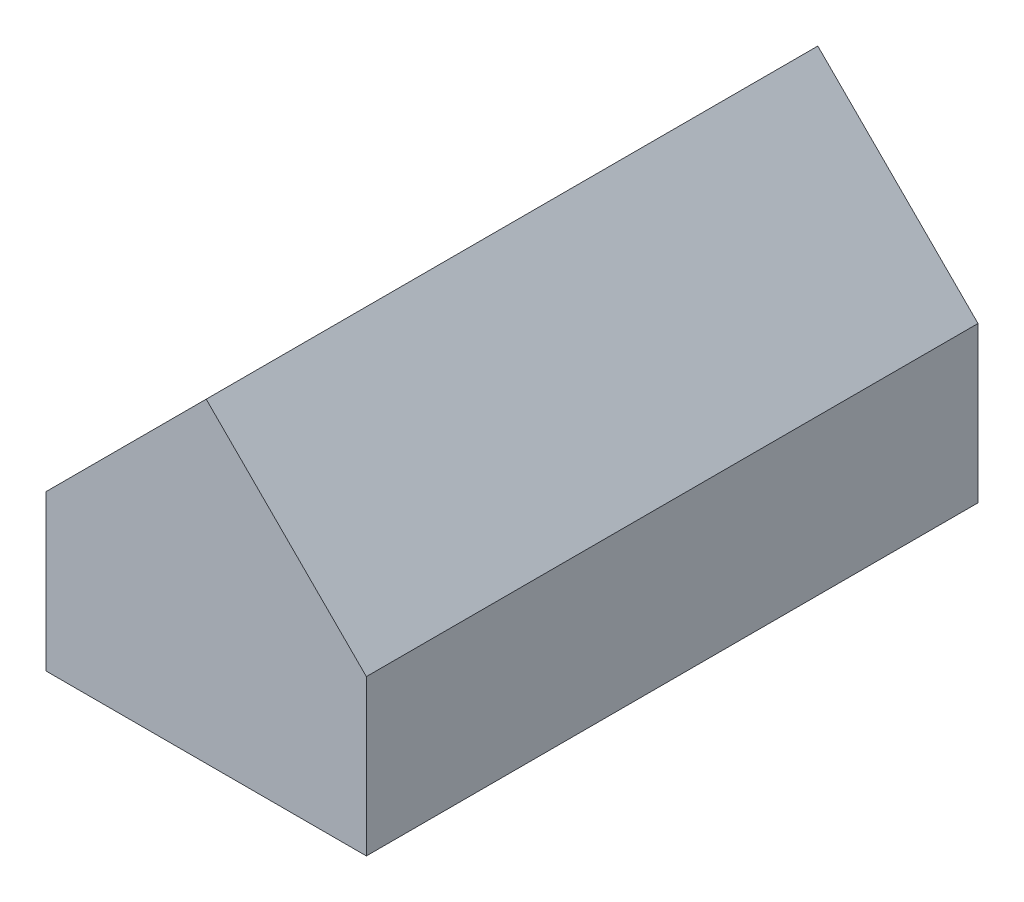
ISO-10303-21;
HEADER;
FILE_DESCRIPTION(('STEP AP214'),'2;1');
FILE_NAME('part.step','',(''),(''),'','','');
FILE_SCHEMA(('AUTOMOTIVE_DESIGN { 1 0 10303 214 1 1 1 1 }'));
ENDSEC;
DATA;
#1=APPLICATION_CONTEXT('core data for automotive mechanical design processes');
#2=APPLICATION_PROTOCOL_DEFINITION('international standard','automotive_design',2000,#1);
#3=PRODUCT_CONTEXT('',#1,'mechanical');
#4=PRODUCT('Part','Part','',(#3));
#5=PRODUCT_RELATED_PRODUCT_CATEGORY('part','',(#4));
#6=PRODUCT_DEFINITION_FORMATION('','',#4);
#7=PRODUCT_DEFINITION_CONTEXT('part definition',#1,'design');
#8=PRODUCT_DEFINITION('design','',#6,#7);
#9=PRODUCT_DEFINITION_SHAPE('','',#8);
#10=(LENGTH_UNIT() NAMED_UNIT(*) SI_UNIT(.MILLI.,.METRE.));
#11=(NAMED_UNIT(*) PLANE_ANGLE_UNIT() SI_UNIT($,.RADIAN.));
#12=(NAMED_UNIT(*) SI_UNIT($,.STERADIAN.) SOLID_ANGLE_UNIT());
#13=UNCERTAINTY_MEASURE_WITH_UNIT(LENGTH_MEASURE(1.E-05),#10,'distance_accuracy_value','');
#14=(GEOMETRIC_REPRESENTATION_CONTEXT(3) GLOBAL_UNCERTAINTY_ASSIGNED_CONTEXT((#13)) GLOBAL_UNIT_ASSIGNED_CONTEXT((#10,
#11,#12)) REPRESENTATION_CONTEXT('',''));
#15=CARTESIAN_POINT('',(0.,0.,0.));
#16=DIRECTION('',(0.,0.,1.));
#17=DIRECTION('',(1.,0.,0.));
#18=AXIS2_PLACEMENT_3D('',#15,#16,#17);
#19=CARTESIAN_POINT('',(0.,0.,6100.));
#20=DIRECTION('',(-1.,0.,0.));
#21=DIRECTION('',(0.,-1.,0.));
#22=AXIS2_PLACEMENT_3D('',#19,#20,#21);
#23=PLANE('',#22);
#24=DIRECTION('',(0.,1.,0.));
#25=VECTOR('',#24,1.);
#26=CARTESIAN_POINT('',(0.,0.,0.));
#27=LINE('',#26,#25);
#28=CARTESIAN_POINT('',(4.4408921777684E-13,-5.83115505291208E-06,0.));
#29=VERTEX_POINT('',#28);
#30=CARTESIAN_POINT('',(-2.22044605038956E-13,1599.99997667537,0.));
#31=VERTEX_POINT('',#30);
#32=EDGE_CURVE('E236',#29,#31,#27,.T.);
#33=ORIENTED_EDGE('',*,*,#32,.T.);
#34=DIRECTION('',(0.,0.,-1.));
#35=VECTOR('',#34,1.);
#36=CARTESIAN_POINT('',(-2.22044605038956E-13,1599.99997667537,6100.));
#37=LINE('',#36,#35);
#38=CARTESIAN_POINT('',(-2.22044605038956E-13,1599.99997667537,6100.));
#39=VERTEX_POINT('',#38);
#40=EDGE_CURVE('E11',#39,#31,#37,.T.);
#41=ORIENTED_EDGE('',*,*,#40,.F.);
#42=DIRECTION('',(0.,1.,0.));
#43=VECTOR('',#42,1.);
#44=CARTESIAN_POINT('',(0.,0.,6100.));
#45=LINE('',#44,#43);
#46=CARTESIAN_POINT('',(1.38777879729552E-13,-5.83115501821761E-06,6100.));
#47=VERTEX_POINT('',#46);
#48=EDGE_CURVE('E228',#47,#39,#45,.T.);
#49=ORIENTED_EDGE('',*,*,#48,.F.);
#50=DIRECTION('',(0.,0.,-1.));
#51=VECTOR('',#50,1.);
#52=CARTESIAN_POINT('',(0.,0.,6100.));
#53=LINE('',#52,#51);
#54=EDGE_CURVE('E52',#47,#29,#53,.T.);
#55=ORIENTED_EDGE('',*,*,#54,.T.);
#56=EDGE_LOOP('',(#33,#41,#49,#55));
#57=FACE_BOUND('',#56,.T.);
#58=ADVANCED_FACE('F35',(#57),#23,.F.);
#59=CARTESIAN_POINT('',(1500.00011662309,3099.99986005227,6100.));
#60=DIRECTION('',(-0.707106726209892,0.707106836163199,0.));
#61=DIRECTION('',(-0.707106836163199,-0.707106726209892,0.));
#62=AXIS2_PLACEMENT_3D('',#59,#60,#61);
#63=PLANE('',#62);
#64=DIRECTION('',(0.707106836163199,0.707106726209892,0.));
#65=VECTOR('',#64,1.);
#66=CARTESIAN_POINT('',(1500.00011662309,3099.99986005227,0.));
#67=LINE('',#66,#65);
#68=CARTESIAN_POINT('',(1500.00011662309,3099.99986005227,0.));
#69=VERTEX_POINT('',#68);
#70=EDGE_CURVE('E232',#31,#69,#67,.T.);
#71=ORIENTED_EDGE('',*,*,#70,.T.);
#72=DIRECTION('',(0.,0.,-1.));
#73=VECTOR('',#72,1.);
#74=CARTESIAN_POINT('',(1500.00011662309,3099.99986005227,6100.));
#75=LINE('',#74,#73);
#76=CARTESIAN_POINT('',(1500.00011662309,3099.99986005227,6100.));
#77=VERTEX_POINT('',#76);
#78=EDGE_CURVE('E44',#77,#69,#75,.T.);
#79=ORIENTED_EDGE('',*,*,#78,.F.);
#80=DIRECTION('',(0.707106836163199,0.707106726209892,0.));
#81=VECTOR('',#80,1.);
#82=CARTESIAN_POINT('',(1500.00011662309,3099.99986005227,6100.));
#83=LINE('',#82,#81);
#84=EDGE_CURVE('E224',#39,#77,#83,.T.);
#85=ORIENTED_EDGE('',*,*,#84,.F.);
#86=ORIENTED_EDGE('',*,*,#40,.T.);
#87=EDGE_LOOP('',(#71,#79,#85,#86));
#88=FACE_BOUND('',#87,.T.);
#89=ADVANCED_FACE('F370',(#88),#63,.F.);
#90=CARTESIAN_POINT('',(1500.00011662309,3099.99986005227,6100.));
#91=DIRECTION('',(0.707106836163201,0.70710672620989,0.));
#92=DIRECTION('',(-0.70710672620989,0.707106836163201,0.));
#93=AXIS2_PLACEMENT_3D('',#90,#91,#92);
#94=PLANE('',#93);
#95=DIRECTION('',(0.70710672620989,-0.707106836163201,0.));
#96=VECTOR('',#95,1.);
#97=CARTESIAN_POINT('',(1500.00011662309,3099.99986005227,0.));
#98=LINE('',#97,#96);
#99=CARTESIAN_POINT('',(2999.99999999999,1599.99974342918,0.));
#100=VERTEX_POINT('',#99);
#101=EDGE_CURVE('E235',#69,#100,#98,.T.);
#102=ORIENTED_EDGE('',*,*,#101,.T.);
#103=DIRECTION('',(0.,0.,-1.));
#104=VECTOR('',#103,1.);
#105=CARTESIAN_POINT('',(2999.99999999999,1599.99974342918,6100.));
#106=LINE('',#105,#104);
#107=CARTESIAN_POINT('',(2999.99999999999,1599.99974342918,6100.));
#108=VERTEX_POINT('',#107);
#109=EDGE_CURVE('E244',#108,#100,#106,.T.);
#110=ORIENTED_EDGE('',*,*,#109,.F.);
#111=DIRECTION('',(0.70710672620989,-0.707106836163201,0.));
#112=VECTOR('',#111,1.);
#113=CARTESIAN_POINT('',(1500.00011662309,3099.99986005227,6100.));
#114=LINE('',#113,#112);
#115=EDGE_CURVE('E227',#77,#108,#114,.T.);
#116=ORIENTED_EDGE('',*,*,#115,.F.);
#117=ORIENTED_EDGE('',*,*,#78,.T.);
#118=EDGE_LOOP('',(#102,#110,#116,#117));
#119=FACE_BOUND('',#118,.T.);
#120=ADVANCED_FACE('F367',(#119),#94,.F.);
#121=CARTESIAN_POINT('',(2999.99999999999,-0.000256570817362689,6100.));
#122=DIRECTION('',(1.,0.,0.));
#123=DIRECTION('',(0.,0.,-1.));
#124=AXIS2_PLACEMENT_3D('',#121,#122,#123);
#125=PLANE('',#124);
#126=DIRECTION('',(0.,-1.,0.));
#127=VECTOR('',#126,1.);
#128=CARTESIAN_POINT('',(2999.99999999999,-0.000256570817362689,0.));
#129=LINE('',#128,#127);
#130=CARTESIAN_POINT('',(2999.99999999999,-0.000250739662201001,0.));
#131=VERTEX_POINT('',#130);
#132=EDGE_CURVE('E238',#100,#131,#129,.T.);
#133=ORIENTED_EDGE('',*,*,#132,.T.);
#134=DIRECTION('',(0.,0.,-1.));
#135=VECTOR('',#134,1.);
#136=CARTESIAN_POINT('',(2999.99999999999,-0.000256570817362689,6100.));
#137=LINE('',#136,#135);
#138=CARTESIAN_POINT('',(2999.99999999999,-0.000250739662201001,6100.));
#139=VERTEX_POINT('',#138);
#140=EDGE_CURVE('E247',#139,#131,#137,.T.);
#141=ORIENTED_EDGE('',*,*,#140,.F.);
#142=DIRECTION('',(0.,-1.,0.));
#143=VECTOR('',#142,1.);
#144=CARTESIAN_POINT('',(2999.99999999999,-0.000256570817362689,6100.));
#145=LINE('',#144,#143);
#146=EDGE_CURVE('E231',#108,#139,#145,.T.);
#147=ORIENTED_EDGE('',*,*,#146,.F.);
#148=ORIENTED_EDGE('',*,*,#109,.T.);
#149=EDGE_LOOP('',(#133,#141,#147,#148));
#150=FACE_BOUND('',#149,.T.);
#151=ADVANCED_FACE('F291',(#150),#125,.F.);
#152=CARTESIAN_POINT('',(3149.99999999999,-0.000256570817362689,6100.));
#153=DIRECTION('',(0.,1.,0.));
#154=DIRECTION('',(0.,0.,1.));
#155=AXIS2_PLACEMENT_3D('',#152,#153,#154);
#156=PLANE('',#155);
#157=CARTESIAN_POINT('',(2999.99999999999,-0.000256570817362689,0.));
#158=DIRECTION('',(1.,0.,0.));
#159=VECTOR('',#158,1.);
#160=LINE('',#157,#159);
#161=CARTESIAN_POINT('',(3149.99999999999,-0.000256570817362689,0.));
#162=VERTEX_POINT('',#161);
#163=EDGE_CURVE('E273',#131,#162,#160,.T.);
#164=ORIENTED_EDGE('',*,*,#163,.T.);
#165=DIRECTION('',(0.,0.,-1.));
#166=VECTOR('',#165,1.);
#167=CARTESIAN_POINT('',(3149.99999999999,-0.000256570817362689,6100.));
#168=LINE('',#167,#166);
#169=CARTESIAN_POINT('',(3149.99999999999,-0.000256570817362689,6100.));
#170=VERTEX_POINT('',#169);
#171=EDGE_CURVE('E243',#170,#162,#168,.T.);
#172=ORIENTED_EDGE('',*,*,#171,.F.);
#173=CARTESIAN_POINT('',(2999.99999999999,-0.000244908507483402,6100.));
#174=DIRECTION('',(0.999999999999997,-7.77487325285815E-08,0.));
#175=VECTOR('',#174,1.);
#176=LINE('',#173,#175);
#177=EDGE_CURVE('E308',#139,#170,#176,.T.);
#178=ORIENTED_EDGE('',*,*,#177,.F.);
#179=ORIENTED_EDGE('',*,*,#140,.T.);
#180=EDGE_LOOP('',(#164,#172,#178,#179));
#181=FACE_BOUND('',#180,.T.);
#182=ADVANCED_FACE('F280',(#181),#156,.F.);
#183=CARTESIAN_POINT('',(3149.99999999999,1599.99974342918,6100.));
#184=DIRECTION('',(-1.,0.,0.));
#185=DIRECTION('',(0.,0.,1.));
#186=AXIS2_PLACEMENT_3D('',#183,#184,#185);
#187=PLANE('',#186);
#188=ORIENTED_EDGE('',*,*,#171,.T.);
#189=DIRECTION('',(0.,0.,1.));
#190=VECTOR('',#189,1.);
#191=CARTESIAN_POINT('',(3149.99999999999,-0.000256570817362689,-100.));
#192=LINE('',#191,#190);
#193=CARTESIAN_POINT('',(3149.99999999999,-0.000256570817362689,-100.));
#194=VERTEX_POINT('',#193);
#195=EDGE_CURVE('E207',#194,#162,#192,.T.);
#196=ORIENTED_EDGE('',*,*,#195,.F.);
#197=DIRECTION('',(0.,-1.,0.));
#198=VECTOR('',#197,1.);
#199=CARTESIAN_POINT('',(3149.99999999999,1599.99974342918,-100.));
#200=LINE('',#199,#198);
#201=CARTESIAN_POINT('',(3149.99999999999,1599.99974342918,-100.));
#202=VERTEX_POINT('',#201);
#203=EDGE_CURVE('E327',#202,#194,#200,.T.);
#204=ORIENTED_EDGE('',*,*,#203,.F.);
#205=DIRECTION('',(0.,0.,-1.));
#206=VECTOR('',#205,1.);
#207=CARTESIAN_POINT('',(3149.99999999999,1599.99974342918,6100.));
#208=LINE('',#207,#206);
#209=CARTESIAN_POINT('',(3149.99999999999,1599.99974342918,6200.));
#210=VERTEX_POINT('',#209);
#211=EDGE_CURVE('E241',#210,#202,#208,.T.);
#212=ORIENTED_EDGE('',*,*,#211,.F.);
#213=DIRECTION('',(0.,1.,0.));
#214=VECTOR('',#213,1.);
#215=CARTESIAN_POINT('',(3149.99999999999,-0.000256570817362689,6200.));
#216=LINE('',#215,#214);
#217=CARTESIAN_POINT('',(3149.99999999999,-0.000256570817362689,6200.));
#218=VERTEX_POINT('',#217);
#219=EDGE_CURVE('E154',#218,#210,#216,.T.);
#220=ORIENTED_EDGE('',*,*,#219,.F.);
#221=DIRECTION('',(0.,0.,-1.));
#222=VECTOR('',#221,1.);
#223=CARTESIAN_POINT('',(3149.99999999999,-0.000256570817362689,6200.));
#224=LINE('',#223,#222);
#225=EDGE_CURVE('E157',#218,#170,#224,.T.);
#226=ORIENTED_EDGE('',*,*,#225,.T.);
#227=EDGE_LOOP('',(#188,#196,#204,#212,#220,#226));
#228=FACE_BOUND('',#227,.T.);
#229=ADVANCED_FACE('F290',(#228),#187,.F.);
#230=CARTESIAN_POINT('',(1500.0001282854,3249.99987171459,6100.));
#231=DIRECTION('',(-0.707106836163202,-0.707106726209889,0.));
#232=DIRECTION('',(0.707106726209889,-0.707106836163202,0.));
#233=AXIS2_PLACEMENT_3D('',#230,#231,#232);
#234=PLANE('',#233);
#235=ORIENTED_EDGE('',*,*,#211,.T.);
#236=DIRECTION('',(0.707106726209889,-0.707106836163202,0.));
#237=VECTOR('',#236,1.);
#238=CARTESIAN_POINT('',(1500.0001282854,3249.99987171459,-100.));
#239=LINE('',#238,#237);
#240=CARTESIAN_POINT('',(1500.0001282854,3249.99987171459,-100.));
#241=VERTEX_POINT('',#240);
#242=EDGE_CURVE('E324',#241,#202,#239,.T.);
#243=ORIENTED_EDGE('',*,*,#242,.F.);
#244=DIRECTION('',(0.,0.,-1.));
#245=VECTOR('',#244,1.);
#246=CARTESIAN_POINT('',(1500.0001282854,3249.99987171459,6100.));
#247=LINE('',#246,#245);
#248=CARTESIAN_POINT('',(1500.0001282854,3249.99987171459,6200.));
#249=VERTEX_POINT('',#248);
#250=EDGE_CURVE('E132',#249,#241,#247,.T.);
#251=ORIENTED_EDGE('',*,*,#250,.F.);
#252=DIRECTION('',(-0.707106726209889,0.707106836163202,0.));
#253=VECTOR('',#252,1.);
#254=CARTESIAN_POINT('',(3149.99999999999,1599.99974342918,6200.));
#255=LINE('',#254,#253);
#256=EDGE_CURVE('E148',#210,#249,#255,.T.);
#257=ORIENTED_EDGE('',*,*,#256,.F.);
#258=EDGE_LOOP('',(#235,#243,#251,#257));
#259=FACE_BOUND('',#258,.T.);
#260=ADVANCED_FACE('F396',(#259),#234,.F.);
#261=CARTESIAN_POINT('',(-150.,1600.,6100.));
#262=DIRECTION('',(0.707106726209889,-0.707106836163201,0.));
#263=DIRECTION('',(0.707106836163201,0.707106726209889,0.));
#264=AXIS2_PLACEMENT_3D('',#261,#262,#263);
#265=PLANE('',#264);
#266=ORIENTED_EDGE('',*,*,#250,.T.);
#267=DIRECTION('',(0.707106836163201,0.707106726209889,0.));
#268=VECTOR('',#267,1.);
#269=CARTESIAN_POINT('',(-150.,1600.,-100.));
#270=LINE('',#269,#268);
#271=CARTESIAN_POINT('',(-150.,1600.,-100.));
#272=VERTEX_POINT('',#271);
#273=EDGE_CURVE('E128',#272,#241,#270,.T.);
#274=ORIENTED_EDGE('',*,*,#273,.F.);
#275=DIRECTION('',(0.,0.,-1.));
#276=VECTOR('',#275,1.);
#277=CARTESIAN_POINT('',(-150.,1600.,6100.));
#278=LINE('',#277,#276);
#279=CARTESIAN_POINT('',(-150.,1600.,6200.));
#280=VERTEX_POINT('',#279);
#281=EDGE_CURVE('E122',#280,#272,#278,.T.);
#282=ORIENTED_EDGE('',*,*,#281,.F.);
#283=DIRECTION('',(-0.707106836163201,-0.707106726209889,0.));
#284=VECTOR('',#283,1.);
#285=CARTESIAN_POINT('',(1500.0001282854,3249.99987171459,6200.));
#286=LINE('',#285,#284);
#287=EDGE_CURVE('E126',#249,#280,#286,.T.);
#288=ORIENTED_EDGE('',*,*,#287,.F.);
#289=EDGE_LOOP('',(#266,#274,#282,#288));
#290=FACE_BOUND('',#289,.T.);
#291=ADVANCED_FACE('F124',(#290),#265,.F.);
#292=CARTESIAN_POINT('',(-150.,0.,6100.));
#293=DIRECTION('',(1.,0.,0.));
#294=DIRECTION('',(0.,0.,-1.));
#295=AXIS2_PLACEMENT_3D('',#292,#293,#294);
#296=PLANE('',#295);
#297=ORIENTED_EDGE('',*,*,#281,.T.);
#298=DIRECTION('',(0.,1.,0.));
#299=VECTOR('',#298,1.);
#300=CARTESIAN_POINT('',(-150.,0.,-100.));
#301=LINE('',#300,#299);
#302=CARTESIAN_POINT('',(-150.,0.,-100.));
#303=VERTEX_POINT('',#302);
#304=EDGE_CURVE('E346',#303,#272,#301,.T.);
#305=ORIENTED_EDGE('',*,*,#304,.F.);
#306=DIRECTION('',(0.,0.,1.));
#307=VECTOR('',#306,1.);
#308=CARTESIAN_POINT('',(-150.,0.,-100.));
#309=LINE('',#308,#307);
#310=CARTESIAN_POINT('',(-150.,0.,0.));
#311=VERTEX_POINT('',#310);
#312=EDGE_CURVE('E347',#303,#311,#309,.T.);
#313=ORIENTED_EDGE('',*,*,#312,.T.);
#314=DIRECTION('',(0.,0.,-1.));
#315=VECTOR('',#314,1.);
#316=CARTESIAN_POINT('',(-150.,0.,6100.));
#317=LINE('',#316,#315);
#318=CARTESIAN_POINT('',(-150.,0.,6100.));
#319=VERTEX_POINT('',#318);
#320=EDGE_CURVE('E133',#319,#311,#317,.T.);
#321=ORIENTED_EDGE('',*,*,#320,.F.);
#322=DIRECTION('',(0.,0.,-1.));
#323=VECTOR('',#322,1.);
#324=CARTESIAN_POINT('',(-150.,0.,6200.));
#325=LINE('',#324,#323);
#326=CARTESIAN_POINT('',(-150.,0.,6200.));
#327=VERTEX_POINT('',#326);
#328=EDGE_CURVE('E139',#327,#319,#325,.T.);
#329=ORIENTED_EDGE('',*,*,#328,.F.);
#330=DIRECTION('',(0.,-1.,0.));
#331=VECTOR('',#330,1.);
#332=CARTESIAN_POINT('',(-150.,1600.,6200.));
#333=LINE('',#332,#331);
#334=EDGE_CURVE('E136',#280,#327,#333,.T.);
#335=ORIENTED_EDGE('',*,*,#334,.F.);
#336=EDGE_LOOP('',(#297,#305,#313,#321,#329,#335));
#337=FACE_BOUND('',#336,.T.);
#338=ADVANCED_FACE('F137',(#337),#296,.F.);
#339=CARTESIAN_POINT('',(0.,0.,6100.));
#340=DIRECTION('',(0.,1.,0.));
#341=DIRECTION('',(-1.,0.,0.));
#342=AXIS2_PLACEMENT_3D('',#339,#340,#341);
#343=PLANE('',#342);
#344=CARTESIAN_POINT('',(-150.,0.,0.));
#345=DIRECTION('',(1.,0.,0.));
#346=VECTOR('',#345,1.);
#347=LINE('',#344,#346);
#348=EDGE_CURVE('E220',#311,#29,#347,.T.);
#349=ORIENTED_EDGE('',*,*,#348,.T.);
#350=ORIENTED_EDGE('',*,*,#54,.F.);
#351=CARTESIAN_POINT('',(-150.,0.,6100.));
#352=DIRECTION('',(0.999999999999997,-7.77487325285817E-08,0.));
#353=VECTOR('',#352,1.);
#354=LINE('',#351,#353);
#355=EDGE_CURVE('E161',#319,#47,#354,.T.);
#356=ORIENTED_EDGE('',*,*,#355,.F.);
#357=ORIENTED_EDGE('',*,*,#320,.T.);
#358=EDGE_LOOP('',(#349,#350,#356,#357));
#359=FACE_BOUND('',#358,.T.);
#360=ADVANCED_FACE('F192',(#359),#343,.F.);
#361=CARTESIAN_POINT('',(0.,0.,0.));
#362=DIRECTION('',(0.,0.,1.));
#363=DIRECTION('',(1.,0.,0.));
#364=AXIS2_PLACEMENT_3D('',#361,#362,#363);
#365=PLANE('',#364);
#366=ORIENTED_EDGE('',*,*,#32,.F.);
#367=DIRECTION('',(-0.999999999999997,7.77487325285817E-08,0.));
#368=VECTOR('',#367,1.);
#369=CARTESIAN_POINT('',(3149.99999999999,-0.000256570817362689,0.));
#370=LINE('',#369,#368);
#371=EDGE_CURVE('E323',#131,#29,#370,.T.);
#372=ORIENTED_EDGE('',*,*,#371,.F.);
#373=ORIENTED_EDGE('',*,*,#132,.F.);
#374=ORIENTED_EDGE('',*,*,#101,.F.);
#375=ORIENTED_EDGE('',*,*,#70,.F.);
#376=EDGE_LOOP('',(#366,#372,#373,#374,#375));
#377=FACE_BOUND('',#376,.T.);
#378=ADVANCED_FACE('F189',(#377),#365,.T.);
#379=CARTESIAN_POINT('',(3149.99999999999,-0.000256570817362689,-100.));
#380=DIRECTION('',(7.77487325285817E-08,0.999999999999997,0.));
#381=DIRECTION('',(-0.999999999999997,7.77487325285817E-08,0.));
#382=AXIS2_PLACEMENT_3D('',#379,#380,#381);
#383=PLANE('',#382);
#384=ORIENTED_EDGE('',*,*,#163,.F.);
#385=ORIENTED_EDGE('',*,*,#371,.T.);
#386=ORIENTED_EDGE('',*,*,#348,.F.);
#387=ORIENTED_EDGE('',*,*,#312,.F.);
#388=DIRECTION('',(-0.999999999999997,7.77487325285817E-08,0.));
#389=VECTOR('',#388,1.);
#390=CARTESIAN_POINT('',(3149.99999999999,-0.000256570817362689,-100.));
#391=LINE('',#390,#389);
#392=EDGE_CURVE('E344',#194,#303,#391,.T.);
#393=ORIENTED_EDGE('',*,*,#392,.F.);
#394=ORIENTED_EDGE('',*,*,#195,.T.);
#395=EDGE_LOOP('',(#384,#385,#386,#387,#393,#394));
#396=FACE_BOUND('',#395,.T.);
#397=ADVANCED_FACE('F187',(#396),#383,.F.);
#398=CARTESIAN_POINT('',(0.,0.,-100.));
#399=DIRECTION('',(0.,0.,1.));
#400=DIRECTION('',(1.,0.,0.));
#401=AXIS2_PLACEMENT_3D('',#398,#399,#400);
#402=PLANE('',#401);
#403=ORIENTED_EDGE('',*,*,#242,.T.);
#404=ORIENTED_EDGE('',*,*,#203,.T.);
#405=ORIENTED_EDGE('',*,*,#392,.T.);
#406=ORIENTED_EDGE('',*,*,#304,.T.);
#407=ORIENTED_EDGE('',*,*,#273,.T.);
#408=EDGE_LOOP('',(#403,#404,#405,#406,#407));
#409=FACE_BOUND('',#408,.T.);
#410=ADVANCED_FACE('F181',(#409),#402,.F.);
#411=CARTESIAN_POINT('',(-150.,0.,6200.));
#412=DIRECTION('',(7.77487325285817E-08,0.999999999999997,0.));
#413=DIRECTION('',(-0.999999999999997,7.77487325285817E-08,0.));
#414=AXIS2_PLACEMENT_3D('',#411,#412,#413);
#415=PLANE('',#414);
#416=ORIENTED_EDGE('',*,*,#355,.T.);
#417=CARTESIAN_POINT('',(0.,-1.1662309897657E-05,6100.));
#418=DIRECTION('',(0.999999999999997,-7.77487325285817E-08,0.));
#419=VECTOR('',#418,1.);
#420=LINE('',#417,#419);
#421=EDGE_CURVE('E149',#47,#139,#420,.T.);
#422=ORIENTED_EDGE('',*,*,#421,.T.);
#423=ORIENTED_EDGE('',*,*,#177,.T.);
#424=ORIENTED_EDGE('',*,*,#225,.F.);
#425=DIRECTION('',(0.999999999999997,-7.77487325285817E-08,0.));
#426=VECTOR('',#425,1.);
#427=CARTESIAN_POINT('',(-150.,0.,6200.));
#428=LINE('',#427,#426);
#429=EDGE_CURVE('E142',#327,#218,#428,.T.);
#430=ORIENTED_EDGE('',*,*,#429,.F.);
#431=ORIENTED_EDGE('',*,*,#328,.T.);
#432=EDGE_LOOP('',(#416,#422,#423,#424,#430,#431));
#433=FACE_BOUND('',#432,.T.);
#434=ADVANCED_FACE('F172',(#433),#415,.F.);
#435=CARTESIAN_POINT('',(0.,0.,6200.));
#436=DIRECTION('',(0.,0.,-1.));
#437=DIRECTION('',(-1.,0.,0.));
#438=AXIS2_PLACEMENT_3D('',#435,#436,#437);
#439=PLANE('',#438);
#440=ORIENTED_EDGE('',*,*,#287,.T.);
#441=ORIENTED_EDGE('',*,*,#334,.T.);
#442=ORIENTED_EDGE('',*,*,#429,.T.);
#443=ORIENTED_EDGE('',*,*,#219,.T.);
#444=ORIENTED_EDGE('',*,*,#256,.T.);
#445=EDGE_LOOP('',(#440,#441,#442,#443,#444));
#446=FACE_BOUND('',#445,.T.);
#447=ADVANCED_FACE('F145',(#446),#439,.F.);
#448=CARTESIAN_POINT('',(0.,0.,6100.));
#449=DIRECTION('',(0.,0.,-1.));
#450=DIRECTION('',(-1.,0.,0.));
#451=AXIS2_PLACEMENT_3D('',#448,#449,#450);
#452=PLANE('',#451);
#453=ORIENTED_EDGE('',*,*,#421,.F.);
#454=ORIENTED_EDGE('',*,*,#48,.T.);
#455=ORIENTED_EDGE('',*,*,#84,.T.);
#456=ORIENTED_EDGE('',*,*,#115,.T.);
#457=ORIENTED_EDGE('',*,*,#146,.T.);
#458=EDGE_LOOP('',(#453,#454,#455,#456,#457));
#459=FACE_BOUND('',#458,.T.);
#460=ADVANCED_FACE('F182',(#459),#452,.T.);
#461=CLOSED_SHELL('',(#58,#89,#120,#151,#182,#229,#260,#291,#338,#360,#378,#397,#410,#434,#447,#460));
#462=MANIFOLD_SOLID_BREP('B2',#461);
#463=ADVANCED_BREP_SHAPE_REPRESENTATION('',(#18,#462),#14);
#464=SHAPE_DEFINITION_REPRESENTATION(#9,#463);
ENDSEC;
END-ISO-10303-21;
